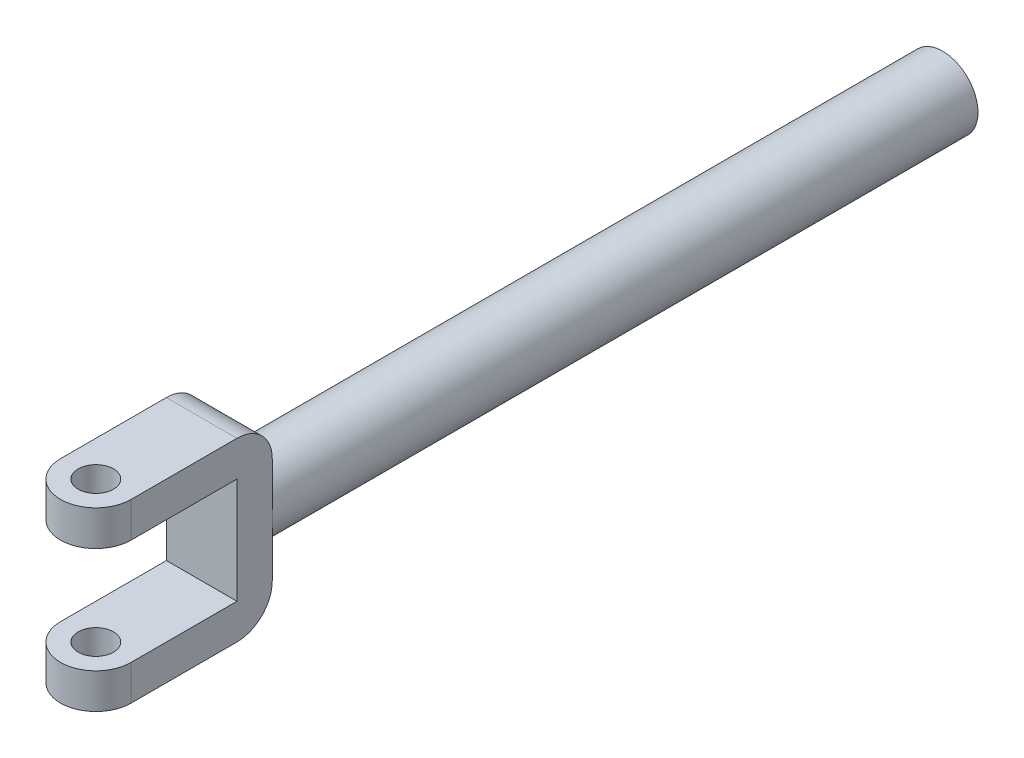
ISO-10303-21;
HEADER;
FILE_DESCRIPTION(('STEP AP214'),'2;1');
FILE_NAME('part.step','',(''),(''),'','','');
FILE_SCHEMA(('AUTOMOTIVE_DESIGN { 1 0 10303 214 1 1 1 1 }'));
ENDSEC;
DATA;
#1=APPLICATION_CONTEXT('core data for automotive mechanical design processes');
#2=APPLICATION_PROTOCOL_DEFINITION('international standard','automotive_design',2000,#1);
#3=PRODUCT_CONTEXT('',#1,'mechanical');
#4=PRODUCT('Part','Part','',(#3));
#5=PRODUCT_RELATED_PRODUCT_CATEGORY('part','',(#4));
#6=PRODUCT_DEFINITION_FORMATION('','',#4);
#7=PRODUCT_DEFINITION_CONTEXT('part definition',#1,'design');
#8=PRODUCT_DEFINITION('design','',#6,#7);
#9=PRODUCT_DEFINITION_SHAPE('','',#8);
#10=(LENGTH_UNIT() NAMED_UNIT(*) SI_UNIT(.MILLI.,.METRE.));
#11=(NAMED_UNIT(*) PLANE_ANGLE_UNIT() SI_UNIT($,.RADIAN.));
#12=(NAMED_UNIT(*) SI_UNIT($,.STERADIAN.) SOLID_ANGLE_UNIT());
#13=UNCERTAINTY_MEASURE_WITH_UNIT(LENGTH_MEASURE(1.E-05),#10,'distance_accuracy_value','');
#14=(GEOMETRIC_REPRESENTATION_CONTEXT(3) GLOBAL_UNCERTAINTY_ASSIGNED_CONTEXT((#13)) GLOBAL_UNIT_ASSIGNED_CONTEXT((#10,
#11,#12)) REPRESENTATION_CONTEXT('',''));
#15=CARTESIAN_POINT('',(0.,0.,0.));
#16=DIRECTION('',(0.,0.,1.));
#17=DIRECTION('',(1.,0.,0.));
#18=AXIS2_PLACEMENT_3D('',#15,#16,#17);
#19=CARTESIAN_POINT('',(-5.,7.5,105.));
#20=DIRECTION('',(-1.,0.,0.));
#21=DIRECTION('',(0.,-1.,0.));
#22=AXIS2_PLACEMENT_3D('',#19,#20,#21);
#23=CYLINDRICAL_SURFACE('',#22,5.);
#24=DIRECTION('',(-1.,0.,0.));
#25=VECTOR('',#24,1.);
#26=CARTESIAN_POINT('',(-5.,12.5,105.));
#27=LINE('',#26,#25);
#28=CARTESIAN_POINT('',(5.,12.5,105.));
#29=VERTEX_POINT('',#28);
#30=CARTESIAN_POINT('',(-5.,12.5,105.));
#31=VERTEX_POINT('',#30);
#32=EDGE_CURVE('E251',#29,#31,#27,.T.);
#33=ORIENTED_EDGE('',*,*,#32,.F.);
#34=CARTESIAN_POINT('',(5.,7.5,105.));
#35=DIRECTION('',(1.,0.,0.));
#36=DIRECTION('',(0.,0.,-1.));
#37=AXIS2_PLACEMENT_3D('',#34,#35,#36);
#38=CIRCLE('',#37,5.);
#39=CARTESIAN_POINT('',(5.,7.5,100.));
#40=VERTEX_POINT('',#39);
#41=EDGE_CURVE('E55',#40,#29,#38,.T.);
#42=ORIENTED_EDGE('',*,*,#41,.F.);
#43=DIRECTION('',(-1.,0.,0.));
#44=VECTOR('',#43,1.);
#45=CARTESIAN_POINT('',(0.,7.5,100.));
#46=LINE('',#45,#44);
#47=CARTESIAN_POINT('',(-5.,7.5,100.));
#48=VERTEX_POINT('',#47);
#49=EDGE_CURVE('E255',#48,#40,#46,.F.);
#50=ORIENTED_EDGE('',*,*,#49,.F.);
#51=CARTESIAN_POINT('',(-5.,7.5,105.));
#52=DIRECTION('',(1.,0.,0.));
#53=DIRECTION('',(0.,0.,-1.));
#54=AXIS2_PLACEMENT_3D('',#51,#52,#53);
#55=CIRCLE('',#54,5.);
#56=EDGE_CURVE('E11',#31,#48,#55,.F.);
#57=ORIENTED_EDGE('',*,*,#56,.F.);
#58=EDGE_LOOP('',(#33,#42,#50,#57));
#59=FACE_BOUND('',#58,.T.);
#60=ADVANCED_FACE('F47',(#59),#23,.T.);
#61=CARTESIAN_POINT('',(-5.,-7.5,105.));
#62=DIRECTION('',(-1.,0.,0.));
#63=DIRECTION('',(0.,-1.,0.));
#64=AXIS2_PLACEMENT_3D('',#61,#62,#63);
#65=CYLINDRICAL_SURFACE('',#64,5.);
#66=DIRECTION('',(1.,0.,0.));
#67=VECTOR('',#66,1.);
#68=CARTESIAN_POINT('',(-5.,-12.5,105.));
#69=LINE('',#68,#67);
#70=CARTESIAN_POINT('',(-5.,-12.5,105.));
#71=VERTEX_POINT('',#70);
#72=CARTESIAN_POINT('',(5.,-12.5,105.));
#73=VERTEX_POINT('',#72);
#74=EDGE_CURVE('E237',#71,#73,#69,.T.);
#75=ORIENTED_EDGE('',*,*,#74,.F.);
#76=CARTESIAN_POINT('',(-5.,-7.5,105.));
#77=DIRECTION('',(1.,0.,0.));
#78=DIRECTION('',(0.,0.,-1.));
#79=AXIS2_PLACEMENT_3D('',#76,#77,#78);
#80=CIRCLE('',#79,5.);
#81=CARTESIAN_POINT('',(-5.,-7.5,100.));
#82=VERTEX_POINT('',#81);
#83=EDGE_CURVE('E245',#82,#71,#80,.F.);
#84=ORIENTED_EDGE('',*,*,#83,.F.);
#85=DIRECTION('',(1.,0.,0.));
#86=VECTOR('',#85,1.);
#87=CARTESIAN_POINT('',(-5.,-7.5,100.));
#88=LINE('',#87,#86);
#89=CARTESIAN_POINT('',(5.,-7.49999999999999,100.));
#90=VERTEX_POINT('',#89);
#91=EDGE_CURVE('E241',#90,#82,#88,.F.);
#92=ORIENTED_EDGE('',*,*,#91,.F.);
#93=CARTESIAN_POINT('',(5.,-7.5,105.));
#94=DIRECTION('',(1.,0.,0.));
#95=DIRECTION('',(0.,0.,-1.));
#96=AXIS2_PLACEMENT_3D('',#93,#94,#95);
#97=CIRCLE('',#96,5.);
#98=EDGE_CURVE('E248',#73,#90,#97,.T.);
#99=ORIENTED_EDGE('',*,*,#98,.F.);
#100=EDGE_LOOP('',(#75,#84,#92,#99));
#101=FACE_BOUND('',#100,.T.);
#102=ADVANCED_FACE('F278',(#101),#65,.T.);
#103=CARTESIAN_POINT('',(0.,-12.5,120.));
#104=DIRECTION('',(0.,-1.,0.));
#105=DIRECTION('',(0.,0.,-1.));
#106=AXIS2_PLACEMENT_3D('',#103,#104,#105);
#107=CYLINDRICAL_SURFACE('',#106,5.);
#108=DIRECTION('',(0.,-1.,0.));
#109=VECTOR('',#108,1.);
#110=CARTESIAN_POINT('',(-5.,12.5,120.));
#111=LINE('',#110,#109);
#112=CARTESIAN_POINT('',(-5.,-12.5,120.));
#113=VERTEX_POINT('',#112);
#114=CARTESIAN_POINT('',(-5.,-7.5,120.));
#115=VERTEX_POINT('',#114);
#116=EDGE_CURVE('E223',#113,#115,#111,.F.);
#117=ORIENTED_EDGE('',*,*,#116,.F.);
#118=CARTESIAN_POINT('',(0.,-12.5,120.));
#119=DIRECTION('',(0.,1.,0.));
#120=DIRECTION('',(-1.,0.,0.));
#121=AXIS2_PLACEMENT_3D('',#118,#119,#120);
#122=CIRCLE('',#121,5.);
#123=CARTESIAN_POINT('',(5.,-12.5,120.));
#124=VERTEX_POINT('',#123);
#125=EDGE_CURVE('E231',#124,#113,#122,.F.);
#126=ORIENTED_EDGE('',*,*,#125,.F.);
#127=DIRECTION('',(0.,1.,0.));
#128=VECTOR('',#127,1.);
#129=CARTESIAN_POINT('',(5.,-12.5,120.));
#130=LINE('',#129,#128);
#131=CARTESIAN_POINT('',(5.,-7.5,120.));
#132=VERTEX_POINT('',#131);
#133=EDGE_CURVE('E227',#132,#124,#130,.F.);
#134=ORIENTED_EDGE('',*,*,#133,.F.);
#135=CARTESIAN_POINT('',(0.,-7.5,120.));
#136=DIRECTION('',(0.,-1.,0.));
#137=DIRECTION('',(0.,0.,-1.));
#138=AXIS2_PLACEMENT_3D('',#135,#136,#137);
#139=CIRCLE('',#138,5.);
#140=EDGE_CURVE('E234',#115,#132,#139,.F.);
#141=ORIENTED_EDGE('',*,*,#140,.F.);
#142=EDGE_LOOP('',(#117,#126,#134,#141));
#143=FACE_BOUND('',#142,.T.);
#144=ADVANCED_FACE('F297',(#143),#107,.T.);
#145=CARTESIAN_POINT('',(0.,7.5,120.));
#146=DIRECTION('',(0.,-1.,0.));
#147=DIRECTION('',(0.,0.,-1.));
#148=AXIS2_PLACEMENT_3D('',#145,#146,#147);
#149=CYLINDRICAL_SURFACE('',#148,5.);
#150=DIRECTION('',(0.,1.,0.));
#151=VECTOR('',#150,1.);
#152=CARTESIAN_POINT('',(-5.,7.5,120.));
#153=LINE('',#152,#151);
#154=CARTESIAN_POINT('',(-5.,7.5,120.));
#155=VERTEX_POINT('',#154);
#156=CARTESIAN_POINT('',(-5.,12.5,120.));
#157=VERTEX_POINT('',#156);
#158=EDGE_CURVE('E202',#155,#157,#153,.T.);
#159=ORIENTED_EDGE('',*,*,#158,.F.);
#160=CARTESIAN_POINT('',(0.,7.5,120.));
#161=DIRECTION('',(0.,1.,0.));
#162=DIRECTION('',(0.,0.,1.));
#163=AXIS2_PLACEMENT_3D('',#160,#161,#162);
#164=CIRCLE('',#163,5.);
#165=CARTESIAN_POINT('',(5.,7.5,120.));
#166=VERTEX_POINT('',#165);
#167=EDGE_CURVE('E217',#166,#155,#164,.F.);
#168=ORIENTED_EDGE('',*,*,#167,.F.);
#169=DIRECTION('',(0.,-1.,0.));
#170=VECTOR('',#169,1.);
#171=CARTESIAN_POINT('',(5.,12.5,120.));
#172=LINE('',#171,#170);
#173=CARTESIAN_POINT('',(5.,12.5,120.));
#174=VERTEX_POINT('',#173);
#175=EDGE_CURVE('E136',#174,#166,#172,.T.);
#176=ORIENTED_EDGE('',*,*,#175,.F.);
#177=CARTESIAN_POINT('',(0.,12.5,120.));
#178=DIRECTION('',(0.,1.,0.));
#179=DIRECTION('',(-1.,0.,0.));
#180=AXIS2_PLACEMENT_3D('',#177,#178,#179);
#181=CIRCLE('',#180,5.);
#182=EDGE_CURVE('E220',#157,#174,#181,.T.);
#183=ORIENTED_EDGE('',*,*,#182,.F.);
#184=EDGE_LOOP('',(#159,#168,#176,#183));
#185=FACE_BOUND('',#184,.T.);
#186=ADVANCED_FACE('F264',(#185),#149,.T.);
#187=CARTESIAN_POINT('',(0.,0.,105.));
#188=DIRECTION('',(0.,0.,-1.));
#189=DIRECTION('',(-1.,0.,0.));
#190=AXIS2_PLACEMENT_3D('',#187,#188,#189);
#191=PLANE('',#190);
#192=DIRECTION('',(1.,0.,0.));
#193=VECTOR('',#192,1.);
#194=CARTESIAN_POINT('',(-5.,7.5,105.));
#195=LINE('',#194,#193);
#196=CARTESIAN_POINT('',(-5.,7.5,105.));
#197=VERTEX_POINT('',#196);
#198=CARTESIAN_POINT('',(5.,7.5,105.));
#199=VERTEX_POINT('',#198);
#200=EDGE_CURVE('E141',#197,#199,#195,.T.);
#201=ORIENTED_EDGE('',*,*,#200,.F.);
#202=DIRECTION('',(0.,-1.,0.));
#203=VECTOR('',#202,1.);
#204=CARTESIAN_POINT('',(-5.,12.5,105.));
#205=LINE('',#204,#203);
#206=CARTESIAN_POINT('',(-5.,-7.5,105.));
#207=VERTEX_POINT('',#206);
#208=EDGE_CURVE('E152',#197,#207,#205,.T.);
#209=ORIENTED_EDGE('',*,*,#208,.T.);
#210=DIRECTION('',(-1.,0.,0.));
#211=VECTOR('',#210,1.);
#212=CARTESIAN_POINT('',(-5.,-7.5,105.));
#213=LINE('',#212,#211);
#214=CARTESIAN_POINT('',(5.,-7.49999999999999,105.));
#215=VERTEX_POINT('',#214);
#216=EDGE_CURVE('E150',#215,#207,#213,.T.);
#217=ORIENTED_EDGE('',*,*,#216,.F.);
#218=DIRECTION('',(0.,-1.,0.));
#219=VECTOR('',#218,1.);
#220=CARTESIAN_POINT('',(5.,12.5,105.));
#221=LINE('',#220,#219);
#222=EDGE_CURVE('E133',#199,#215,#221,.T.);
#223=ORIENTED_EDGE('',*,*,#222,.F.);
#224=EDGE_LOOP('',(#201,#209,#217,#223));
#225=FACE_BOUND('',#224,.T.);
#226=ADVANCED_FACE('F146',(#225),#191,.F.);
#227=CARTESIAN_POINT('',(0.,0.,100.));
#228=DIRECTION('',(0.,0.,-1.));
#229=DIRECTION('',(-1.,0.,0.));
#230=AXIS2_PLACEMENT_3D('',#227,#228,#229);
#231=CYLINDRICAL_SURFACE('',#230,5.);
#232=CARTESIAN_POINT('',(0.,0.,100.));
#233=DIRECTION('',(0.,0.,1.));
#234=DIRECTION('',(1.,0.,0.));
#235=AXIS2_PLACEMENT_3D('',#232,#233,#234);
#236=CIRCLE('',#235,5.);
#237=CARTESIAN_POINT('',(5.,0.,100.));
#238=VERTEX_POINT('',#237);
#239=CARTESIAN_POINT('',(-5.,0.,100.));
#240=VERTEX_POINT('',#239);
#241=EDGE_CURVE('E198',#238,#240,#236,.T.);
#242=ORIENTED_EDGE('',*,*,#241,.F.);
#243=EDGE_CURVE('E203',#240,#238,#236,.T.);
#244=ORIENTED_EDGE('',*,*,#243,.F.);
#245=EDGE_LOOP('',(#242,#244));
#246=FACE_BOUND('',#245,.T.);
#247=CARTESIAN_POINT('',(0.,0.,0.));
#248=DIRECTION('',(0.,0.,1.));
#249=DIRECTION('',(1.,0.,0.));
#250=AXIS2_PLACEMENT_3D('',#247,#248,#249);
#251=CIRCLE('',#250,5.);
#252=CARTESIAN_POINT('',(5.,0.,0.));
#253=VERTEX_POINT('',#252);
#254=EDGE_CURVE('E186',#253,#253,#251,.T.);
#255=ORIENTED_EDGE('',*,*,#254,.T.);
#256=EDGE_LOOP('',(#255));
#257=FACE_BOUND('',#256,.T.);
#258=ADVANCED_FACE('F292',(#246,#257),#231,.T.);
#259=CARTESIAN_POINT('',(0.,0.,0.));
#260=DIRECTION('',(0.,0.,1.));
#261=DIRECTION('',(1.,0.,0.));
#262=AXIS2_PLACEMENT_3D('',#259,#260,#261);
#263=PLANE('',#262);
#264=ORIENTED_EDGE('',*,*,#254,.F.);
#265=EDGE_LOOP('',(#264));
#266=FACE_BOUND('',#265,.T.);
#267=ADVANCED_FACE('F323',(#266),#263,.F.);
#268=CARTESIAN_POINT('',(0.,0.,100.));
#269=DIRECTION('',(0.,0.,-1.));
#270=DIRECTION('',(-1.,0.,0.));
#271=AXIS2_PLACEMENT_3D('',#268,#269,#270);
#272=PLANE('',#271);
#273=DIRECTION('',(0.,-1.,0.));
#274=VECTOR('',#273,1.);
#275=CARTESIAN_POINT('',(-5.,12.5,100.));
#276=LINE('',#275,#274);
#277=EDGE_CURVE('E153',#48,#240,#276,.T.);
#278=ORIENTED_EDGE('',*,*,#277,.F.);
#279=ORIENTED_EDGE('',*,*,#49,.T.);
#280=DIRECTION('',(0.,-1.,0.));
#281=VECTOR('',#280,1.);
#282=CARTESIAN_POINT('',(5.,12.5,100.));
#283=LINE('',#282,#281);
#284=EDGE_CURVE('E177',#40,#238,#283,.T.);
#285=ORIENTED_EDGE('',*,*,#284,.T.);
#286=ORIENTED_EDGE('',*,*,#241,.T.);
#287=EDGE_LOOP('',(#278,#279,#285,#286));
#288=FACE_BOUND('',#287,.T.);
#289=ADVANCED_FACE('F296',(#288),#272,.T.);
#290=CARTESIAN_POINT('',(-5.,12.5,105.));
#291=DIRECTION('',(0.,1.,0.));
#292=DIRECTION('',(-1.,0.,0.));
#293=AXIS2_PLACEMENT_3D('',#290,#291,#292);
#294=PLANE('',#293);
#295=CARTESIAN_POINT('',(0.,12.5,120.));
#296=DIRECTION('',(0.,-1.,0.));
#297=DIRECTION('',(0.,0.,-1.));
#298=AXIS2_PLACEMENT_3D('',#295,#296,#297);
#299=CIRCLE('',#298,2.5);
#300=CARTESIAN_POINT('',(0.,12.5,117.5));
#301=VERTEX_POINT('',#300);
#302=EDGE_CURVE('E211',#301,#301,#299,.T.);
#303=ORIENTED_EDGE('',*,*,#302,.T.);
#304=EDGE_LOOP('',(#303));
#305=FACE_BOUND('',#304,.T.);
#306=DIRECTION('',(0.,0.,-1.));
#307=VECTOR('',#306,1.);
#308=CARTESIAN_POINT('',(5.,12.5,105.));
#309=LINE('',#308,#307);
#310=EDGE_CURVE('E176',#174,#29,#309,.T.);
#311=ORIENTED_EDGE('',*,*,#310,.T.);
#312=ORIENTED_EDGE('',*,*,#32,.T.);
#313=DIRECTION('',(0.,0.,-1.));
#314=VECTOR('',#313,1.);
#315=CARTESIAN_POINT('',(-5.,12.5,105.));
#316=LINE('',#315,#314);
#317=EDGE_CURVE('E183',#157,#31,#316,.T.);
#318=ORIENTED_EDGE('',*,*,#317,.F.);
#319=ORIENTED_EDGE('',*,*,#182,.T.);
#320=EDGE_LOOP('',(#311,#312,#318,#319));
#321=FACE_BOUND('',#320,.T.);
#322=ADVANCED_FACE('F261',(#305,#321),#294,.T.);
#323=CARTESIAN_POINT('',(-5.,12.5,105.));
#324=DIRECTION('',(1.,0.,0.));
#325=DIRECTION('',(0.,0.,-1.));
#326=AXIS2_PLACEMENT_3D('',#323,#324,#325);
#327=PLANE('',#326);
#328=ORIENTED_EDGE('',*,*,#317,.T.);
#329=ORIENTED_EDGE('',*,*,#56,.T.);
#330=ORIENTED_EDGE('',*,*,#277,.T.);
#331=EDGE_CURVE('E180',#240,#82,#276,.T.);
#332=ORIENTED_EDGE('',*,*,#331,.T.);
#333=ORIENTED_EDGE('',*,*,#83,.T.);
#334=DIRECTION('',(0.,0.,-1.));
#335=VECTOR('',#334,1.);
#336=CARTESIAN_POINT('',(-5.,-12.5,105.));
#337=LINE('',#336,#335);
#338=EDGE_CURVE('E187',#113,#71,#337,.T.);
#339=ORIENTED_EDGE('',*,*,#338,.F.);
#340=ORIENTED_EDGE('',*,*,#116,.T.);
#341=DIRECTION('',(0.,0.,-1.));
#342=VECTOR('',#341,1.);
#343=CARTESIAN_POINT('',(-5.,-7.5,125.));
#344=LINE('',#343,#342);
#345=EDGE_CURVE('E160',#115,#207,#344,.T.);
#346=ORIENTED_EDGE('',*,*,#345,.T.);
#347=ORIENTED_EDGE('',*,*,#208,.F.);
#348=DIRECTION('',(0.,0.,-1.));
#349=VECTOR('',#348,1.);
#350=CARTESIAN_POINT('',(-5.,7.5,125.));
#351=LINE('',#350,#349);
#352=EDGE_CURVE('E140',#155,#197,#351,.T.);
#353=ORIENTED_EDGE('',*,*,#352,.F.);
#354=ORIENTED_EDGE('',*,*,#158,.T.);
#355=EDGE_LOOP('',(#328,#329,#330,#332,#333,#339,#340,#346,#347,#353,#354));
#356=FACE_BOUND('',#355,.T.);
#357=ADVANCED_FACE('F265',(#356),#327,.F.);
#358=CARTESIAN_POINT('',(-5.,-12.5,105.));
#359=DIRECTION('',(0.,1.,0.));
#360=DIRECTION('',(-1.,0.,0.));
#361=AXIS2_PLACEMENT_3D('',#358,#359,#360);
#362=PLANE('',#361);
#363=CARTESIAN_POINT('',(0.,-12.5,120.));
#364=DIRECTION('',(0.,-1.,0.));
#365=DIRECTION('',(0.,0.,-1.));
#366=AXIS2_PLACEMENT_3D('',#363,#364,#365);
#367=CIRCLE('',#366,2.5);
#368=CARTESIAN_POINT('',(0.,-12.5,117.5));
#369=VERTEX_POINT('',#368);
#370=EDGE_CURVE('E462',#369,#369,#367,.T.);
#371=ORIENTED_EDGE('',*,*,#370,.F.);
#372=EDGE_LOOP('',(#371));
#373=FACE_BOUND('',#372,.T.);
#374=ORIENTED_EDGE('',*,*,#338,.T.);
#375=ORIENTED_EDGE('',*,*,#74,.T.);
#376=DIRECTION('',(0.,0.,-1.));
#377=VECTOR('',#376,1.);
#378=CARTESIAN_POINT('',(5.,-12.5,105.));
#379=LINE('',#378,#377);
#380=EDGE_CURVE('E191',#124,#73,#379,.T.);
#381=ORIENTED_EDGE('',*,*,#380,.F.);
#382=ORIENTED_EDGE('',*,*,#125,.T.);
#383=EDGE_LOOP('',(#374,#375,#381,#382));
#384=FACE_BOUND('',#383,.T.);
#385=ADVANCED_FACE('F273',(#373,#384),#362,.F.);
#386=CARTESIAN_POINT('',(5.,12.5,105.));
#387=DIRECTION('',(1.,0.,0.));
#388=DIRECTION('',(0.,0.,-1.));
#389=AXIS2_PLACEMENT_3D('',#386,#387,#388);
#390=PLANE('',#389);
#391=ORIENTED_EDGE('',*,*,#284,.F.);
#392=ORIENTED_EDGE('',*,*,#41,.T.);
#393=ORIENTED_EDGE('',*,*,#310,.F.);
#394=ORIENTED_EDGE('',*,*,#175,.T.);
#395=DIRECTION('',(0.,0.,-1.));
#396=VECTOR('',#395,1.);
#397=CARTESIAN_POINT('',(5.,7.5,125.));
#398=LINE('',#397,#396);
#399=EDGE_CURVE('E128',#166,#199,#398,.T.);
#400=ORIENTED_EDGE('',*,*,#399,.T.);
#401=ORIENTED_EDGE('',*,*,#222,.T.);
#402=DIRECTION('',(0.,0.,-1.));
#403=VECTOR('',#402,1.);
#404=CARTESIAN_POINT('',(5.,-7.5,125.));
#405=LINE('',#404,#403);
#406=EDGE_CURVE('E169',#132,#215,#405,.T.);
#407=ORIENTED_EDGE('',*,*,#406,.F.);
#408=ORIENTED_EDGE('',*,*,#133,.T.);
#409=ORIENTED_EDGE('',*,*,#380,.T.);
#410=ORIENTED_EDGE('',*,*,#98,.T.);
#411=EDGE_CURVE('E168',#238,#90,#283,.T.);
#412=ORIENTED_EDGE('',*,*,#411,.F.);
#413=EDGE_LOOP('',(#391,#392,#393,#394,#400,#401,#407,#408,#409,#410,#412));
#414=FACE_BOUND('',#413,.T.);
#415=ADVANCED_FACE('F131',(#414),#390,.T.);
#416=ORIENTED_EDGE('',*,*,#411,.T.);
#417=ORIENTED_EDGE('',*,*,#91,.T.);
#418=ORIENTED_EDGE('',*,*,#331,.F.);
#419=ORIENTED_EDGE('',*,*,#243,.T.);
#420=EDGE_LOOP('',(#416,#417,#418,#419));
#421=FACE_BOUND('',#420,.T.);
#422=ADVANCED_FACE('F289',(#421),#272,.T.);
#423=CARTESIAN_POINT('',(-5.,-7.5,125.));
#424=DIRECTION('',(0.,-1.,0.));
#425=DIRECTION('',(0.,0.,-1.));
#426=AXIS2_PLACEMENT_3D('',#423,#424,#425);
#427=PLANE('',#426);
#428=CARTESIAN_POINT('',(0.,-7.5,120.));
#429=DIRECTION('',(0.,-1.,0.));
#430=DIRECTION('',(0.,0.,-1.));
#431=AXIS2_PLACEMENT_3D('',#428,#429,#430);
#432=CIRCLE('',#431,2.5);
#433=CARTESIAN_POINT('',(0.,-7.5,117.5));
#434=VERTEX_POINT('',#433);
#435=EDGE_CURVE('E163',#434,#434,#432,.T.);
#436=ORIENTED_EDGE('',*,*,#435,.T.);
#437=EDGE_LOOP('',(#436));
#438=FACE_BOUND('',#437,.T.);
#439=ORIENTED_EDGE('',*,*,#345,.F.);
#440=ORIENTED_EDGE('',*,*,#140,.T.);
#441=ORIENTED_EDGE('',*,*,#406,.T.);
#442=ORIENTED_EDGE('',*,*,#216,.T.);
#443=EDGE_LOOP('',(#439,#440,#441,#442));
#444=FACE_BOUND('',#443,.T.);
#445=ADVANCED_FACE('F268',(#438,#444),#427,.F.);
#446=CARTESIAN_POINT('',(-5.,7.5,125.));
#447=DIRECTION('',(0.,1.,0.));
#448=DIRECTION('',(0.,0.,1.));
#449=AXIS2_PLACEMENT_3D('',#446,#447,#448);
#450=PLANE('',#449);
#451=CARTESIAN_POINT('',(0.,7.5,120.));
#452=DIRECTION('',(0.,1.,0.));
#453=DIRECTION('',(0.,0.,1.));
#454=AXIS2_PLACEMENT_3D('',#451,#452,#453);
#455=CIRCLE('',#454,2.5);
#456=CARTESIAN_POINT('',(0.,7.5,122.5));
#457=VERTEX_POINT('',#456);
#458=EDGE_CURVE('E207',#457,#457,#455,.T.);
#459=ORIENTED_EDGE('',*,*,#458,.T.);
#460=EDGE_LOOP('',(#459));
#461=FACE_BOUND('',#460,.T.);
#462=ORIENTED_EDGE('',*,*,#399,.F.);
#463=ORIENTED_EDGE('',*,*,#167,.T.);
#464=ORIENTED_EDGE('',*,*,#352,.T.);
#465=ORIENTED_EDGE('',*,*,#200,.T.);
#466=EDGE_LOOP('',(#462,#463,#464,#465));
#467=FACE_BOUND('',#466,.T.);
#468=ADVANCED_FACE('F155',(#461,#467),#450,.F.);
#469=CARTESIAN_POINT('',(0.,12.5,120.));
#470=DIRECTION('',(0.,-1.,0.));
#471=DIRECTION('',(0.,0.,-1.));
#472=AXIS2_PLACEMENT_3D('',#469,#470,#471);
#473=CYLINDRICAL_SURFACE('',#472,2.5);
#474=ORIENTED_EDGE('',*,*,#302,.F.);
#475=EDGE_LOOP('',(#474));
#476=FACE_BOUND('',#475,.T.);
#477=ORIENTED_EDGE('',*,*,#458,.F.);
#478=EDGE_LOOP('',(#477));
#479=FACE_BOUND('',#478,.T.);
#480=ADVANCED_FACE('F369',(#476,#479),#473,.F.);
#481=ORIENTED_EDGE('',*,*,#370,.T.);
#482=EDGE_LOOP('',(#481));
#483=FACE_BOUND('',#482,.T.);
#484=ORIENTED_EDGE('',*,*,#435,.F.);
#485=EDGE_LOOP('',(#484));
#486=FACE_BOUND('',#485,.T.);
#487=ADVANCED_FACE('F379',(#483,#486),#473,.F.);
#488=CLOSED_SHELL('',(#60,#102,#144,#186,#226,#258,#267,#289,#322,#357,#385,#415,#422,#445,#468,
#480,#487));
#489=MANIFOLD_SOLID_BREP('B2',#488);
#490=ADVANCED_BREP_SHAPE_REPRESENTATION('',(#18,#489),#14);
#491=SHAPE_DEFINITION_REPRESENTATION(#9,#490);
ENDSEC;
END-ISO-10303-21;
